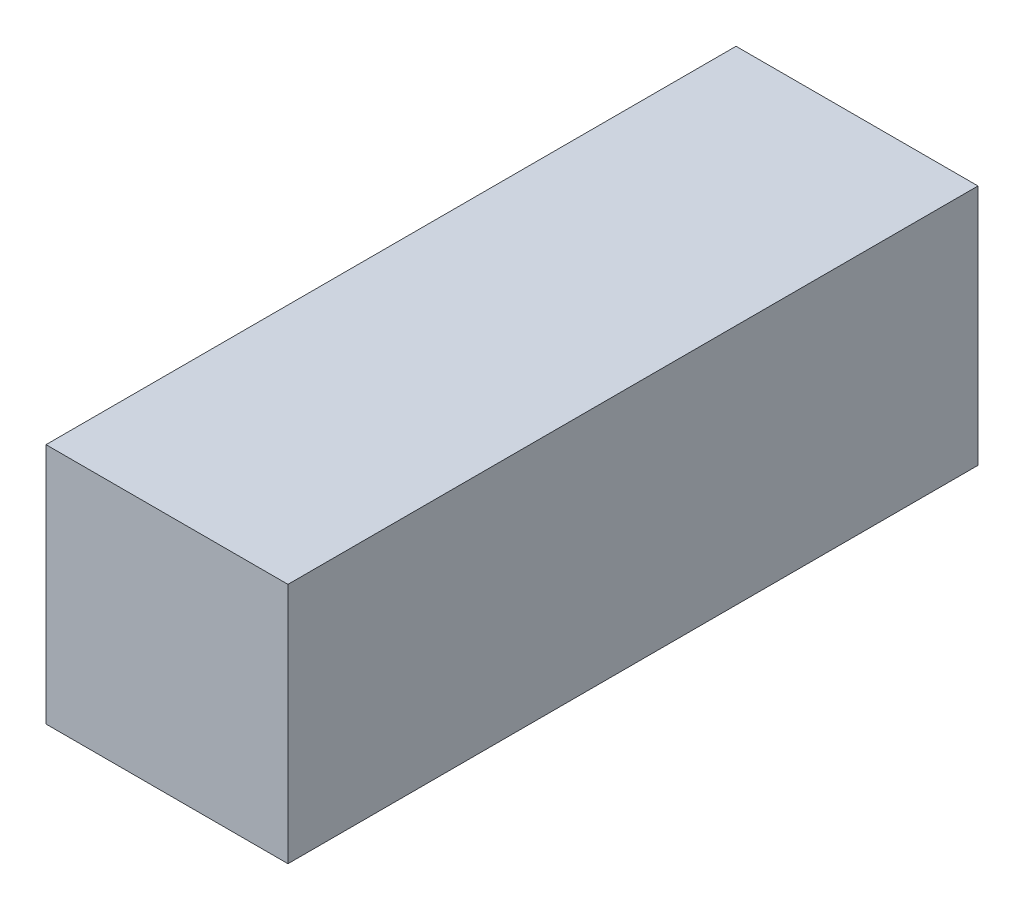
ISO-10303-21;
HEADER;
FILE_DESCRIPTION(('STEP AP214'),'2;1');
FILE_NAME('part.step','',(''),(''),'','','');
FILE_SCHEMA(('AUTOMOTIVE_DESIGN { 1 0 10303 214 1 1 1 1 }'));
ENDSEC;
DATA;
#1=APPLICATION_CONTEXT('core data for automotive mechanical design processes');
#2=APPLICATION_PROTOCOL_DEFINITION('international standard','automotive_design',2000,#1);
#3=PRODUCT_CONTEXT('',#1,'mechanical');
#4=PRODUCT('Part','Part','',(#3));
#5=PRODUCT_RELATED_PRODUCT_CATEGORY('part','',(#4));
#6=PRODUCT_DEFINITION_FORMATION('','',#4);
#7=PRODUCT_DEFINITION_CONTEXT('part definition',#1,'design');
#8=PRODUCT_DEFINITION('design','',#6,#7);
#9=PRODUCT_DEFINITION_SHAPE('','',#8);
#10=(LENGTH_UNIT() NAMED_UNIT(*) SI_UNIT(.MILLI.,.METRE.));
#11=(NAMED_UNIT(*) PLANE_ANGLE_UNIT() SI_UNIT($,.RADIAN.));
#12=(NAMED_UNIT(*) SI_UNIT($,.STERADIAN.) SOLID_ANGLE_UNIT());
#13=UNCERTAINTY_MEASURE_WITH_UNIT(LENGTH_MEASURE(1.E-05),#10,'distance_accuracy_value','');
#14=(GEOMETRIC_REPRESENTATION_CONTEXT(3) GLOBAL_UNCERTAINTY_ASSIGNED_CONTEXT((#13)) GLOBAL_UNIT_ASSIGNED_CONTEXT((#10,
#11,#12)) REPRESENTATION_CONTEXT('',''));
#15=CARTESIAN_POINT('',(0.,0.,0.));
#16=DIRECTION('',(0.,0.,1.));
#17=DIRECTION('',(1.,0.,0.));
#18=AXIS2_PLACEMENT_3D('',#15,#16,#17);
#19=CARTESIAN_POINT('',(2.7,-1.35,3.85));
#20=DIRECTION('',(0.,0.,-1.));
#21=DIRECTION('',(-1.,0.,0.));
#22=AXIS2_PLACEMENT_3D('',#19,#20,#21);
#23=PLANE('',#22);
#24=DIRECTION('',(0.,-1.,0.));
#25=VECTOR('',#24,1.);
#26=CARTESIAN_POINT('',(0.,-1.35,3.85));
#27=LINE('',#26,#25);
#28=CARTESIAN_POINT('',(0.,1.35,3.85));
#29=VERTEX_POINT('',#28);
#30=CARTESIAN_POINT('',(0.,-1.35,3.85));
#31=VERTEX_POINT('',#30);
#32=EDGE_CURVE('E96',#29,#31,#27,.T.);
#33=ORIENTED_EDGE('',*,*,#32,.T.);
#34=DIRECTION('',(-1.,0.,0.));
#35=VECTOR('',#34,1.);
#36=CARTESIAN_POINT('',(2.7,-1.35,3.85));
#37=LINE('',#36,#35);
#38=CARTESIAN_POINT('',(2.7,-1.35,3.85));
#39=VERTEX_POINT('',#38);
#40=EDGE_CURVE('E11',#39,#31,#37,.T.);
#41=ORIENTED_EDGE('',*,*,#40,.F.);
#42=DIRECTION('',(0.,-1.,0.));
#43=VECTOR('',#42,1.);
#44=CARTESIAN_POINT('',(2.7,-1.35,3.85));
#45=LINE('',#44,#43);
#46=CARTESIAN_POINT('',(2.7,1.35,3.85));
#47=VERTEX_POINT('',#46);
#48=EDGE_CURVE('E84',#47,#39,#45,.T.);
#49=ORIENTED_EDGE('',*,*,#48,.F.);
#50=DIRECTION('',(-1.,0.,0.));
#51=VECTOR('',#50,1.);
#52=CARTESIAN_POINT('',(2.7,1.35,3.85));
#53=LINE('',#52,#51);
#54=EDGE_CURVE('E92',#47,#29,#53,.T.);
#55=ORIENTED_EDGE('',*,*,#54,.T.);
#56=EDGE_LOOP('',(#33,#41,#49,#55));
#57=FACE_BOUND('',#56,.T.);
#58=ADVANCED_FACE('F33',(#57),#23,.F.);
#59=CARTESIAN_POINT('',(2.7,-1.35,-3.85));
#60=DIRECTION('',(0.,1.,0.));
#61=DIRECTION('',(0.,0.,1.));
#62=AXIS2_PLACEMENT_3D('',#59,#60,#61);
#63=PLANE('',#62);
#64=DIRECTION('',(0.,0.,-1.));
#65=VECTOR('',#64,1.);
#66=CARTESIAN_POINT('',(0.,-1.35,-3.85));
#67=LINE('',#66,#65);
#68=CARTESIAN_POINT('',(0.,-1.35,-3.85));
#69=VERTEX_POINT('',#68);
#70=EDGE_CURVE('E88',#31,#69,#67,.T.);
#71=ORIENTED_EDGE('',*,*,#70,.T.);
#72=DIRECTION('',(-1.,0.,0.));
#73=VECTOR('',#72,1.);
#74=CARTESIAN_POINT('',(2.7,-1.35,-3.85));
#75=LINE('',#74,#73);
#76=CARTESIAN_POINT('',(2.7,-1.35,-3.85));
#77=VERTEX_POINT('',#76);
#78=EDGE_CURVE('E41',#77,#69,#75,.T.);
#79=ORIENTED_EDGE('',*,*,#78,.F.);
#80=DIRECTION('',(0.,0.,-1.));
#81=VECTOR('',#80,1.);
#82=CARTESIAN_POINT('',(2.7,-1.35,-3.85));
#83=LINE('',#82,#81);
#84=EDGE_CURVE('E79',#39,#77,#83,.T.);
#85=ORIENTED_EDGE('',*,*,#84,.F.);
#86=ORIENTED_EDGE('',*,*,#40,.T.);
#87=EDGE_LOOP('',(#71,#79,#85,#86));
#88=FACE_BOUND('',#87,.T.);
#89=ADVANCED_FACE('F87',(#88),#63,.F.);
#90=CARTESIAN_POINT('',(2.7,-1.35,-3.85));
#91=DIRECTION('',(0.,0.,1.));
#92=DIRECTION('',(1.,0.,0.));
#93=AXIS2_PLACEMENT_3D('',#90,#91,#92);
#94=PLANE('',#93);
#95=DIRECTION('',(0.,1.,0.));
#96=VECTOR('',#95,1.);
#97=CARTESIAN_POINT('',(0.,-1.35,-3.85));
#98=LINE('',#97,#96);
#99=CARTESIAN_POINT('',(0.,1.35,-3.85));
#100=VERTEX_POINT('',#99);
#101=EDGE_CURVE('E66',#69,#100,#98,.T.);
#102=ORIENTED_EDGE('',*,*,#101,.T.);
#103=DIRECTION('',(-1.,0.,0.));
#104=VECTOR('',#103,1.);
#105=CARTESIAN_POINT('',(2.7,1.35,-3.85));
#106=LINE('',#105,#104);
#107=CARTESIAN_POINT('',(2.7,1.35,-3.85));
#108=VERTEX_POINT('',#107);
#109=EDGE_CURVE('E89',#108,#100,#106,.T.);
#110=ORIENTED_EDGE('',*,*,#109,.F.);
#111=DIRECTION('',(0.,1.,0.));
#112=VECTOR('',#111,1.);
#113=CARTESIAN_POINT('',(2.7,-1.35,-3.85));
#114=LINE('',#113,#112);
#115=EDGE_CURVE('E82',#77,#108,#114,.T.);
#116=ORIENTED_EDGE('',*,*,#115,.F.);
#117=ORIENTED_EDGE('',*,*,#78,.T.);
#118=EDGE_LOOP('',(#102,#110,#116,#117));
#119=FACE_BOUND('',#118,.T.);
#120=ADVANCED_FACE('F90',(#119),#94,.F.);
#121=CARTESIAN_POINT('',(2.7,1.35,-3.85));
#122=DIRECTION('',(0.,-1.,0.));
#123=DIRECTION('',(0.,0.,-1.));
#124=AXIS2_PLACEMENT_3D('',#121,#122,#123);
#125=PLANE('',#124);
#126=DIRECTION('',(0.,0.,1.));
#127=VECTOR('',#126,1.);
#128=CARTESIAN_POINT('',(0.,1.35,-3.85));
#129=LINE('',#128,#127);
#130=EDGE_CURVE('E72',#100,#29,#129,.T.);
#131=ORIENTED_EDGE('',*,*,#130,.T.);
#132=ORIENTED_EDGE('',*,*,#54,.F.);
#133=DIRECTION('',(0.,0.,1.));
#134=VECTOR('',#133,1.);
#135=CARTESIAN_POINT('',(2.7,1.35,-3.85));
#136=LINE('',#135,#134);
#137=EDGE_CURVE('E49',#108,#47,#136,.T.);
#138=ORIENTED_EDGE('',*,*,#137,.F.);
#139=ORIENTED_EDGE('',*,*,#109,.T.);
#140=EDGE_LOOP('',(#131,#132,#138,#139));
#141=FACE_BOUND('',#140,.T.);
#142=ADVANCED_FACE('F103',(#141),#125,.F.);
#143=CARTESIAN_POINT('',(2.7,0.,0.));
#144=DIRECTION('',(1.,0.,0.));
#145=DIRECTION('',(0.,0.,-1.));
#146=AXIS2_PLACEMENT_3D('',#143,#144,#145);
#147=PLANE('',#146);
#148=ORIENTED_EDGE('',*,*,#48,.T.);
#149=ORIENTED_EDGE('',*,*,#84,.T.);
#150=ORIENTED_EDGE('',*,*,#115,.T.);
#151=ORIENTED_EDGE('',*,*,#137,.T.);
#152=EDGE_LOOP('',(#148,#149,#150,#151));
#153=FACE_BOUND('',#152,.T.);
#154=ADVANCED_FACE('F80',(#153),#147,.T.);
#155=CARTESIAN_POINT('',(0.,0.,0.));
#156=DIRECTION('',(1.,0.,0.));
#157=DIRECTION('',(0.,0.,-1.));
#158=AXIS2_PLACEMENT_3D('',#155,#156,#157);
#159=PLANE('',#158);
#160=ORIENTED_EDGE('',*,*,#32,.F.);
#161=ORIENTED_EDGE('',*,*,#130,.F.);
#162=ORIENTED_EDGE('',*,*,#101,.F.);
#163=ORIENTED_EDGE('',*,*,#70,.F.);
#164=EDGE_LOOP('',(#160,#161,#162,#163));
#165=FACE_BOUND('',#164,.T.);
#166=ADVANCED_FACE('F106',(#165),#159,.F.);
#167=CLOSED_SHELL('',(#58,#89,#120,#142,#154,#166));
#168=MANIFOLD_SOLID_BREP('B2',#167);
#169=ADVANCED_BREP_SHAPE_REPRESENTATION('',(#18,#168),#14);
#170=SHAPE_DEFINITION_REPRESENTATION(#9,#169);
ENDSEC;
END-ISO-10303-21;
